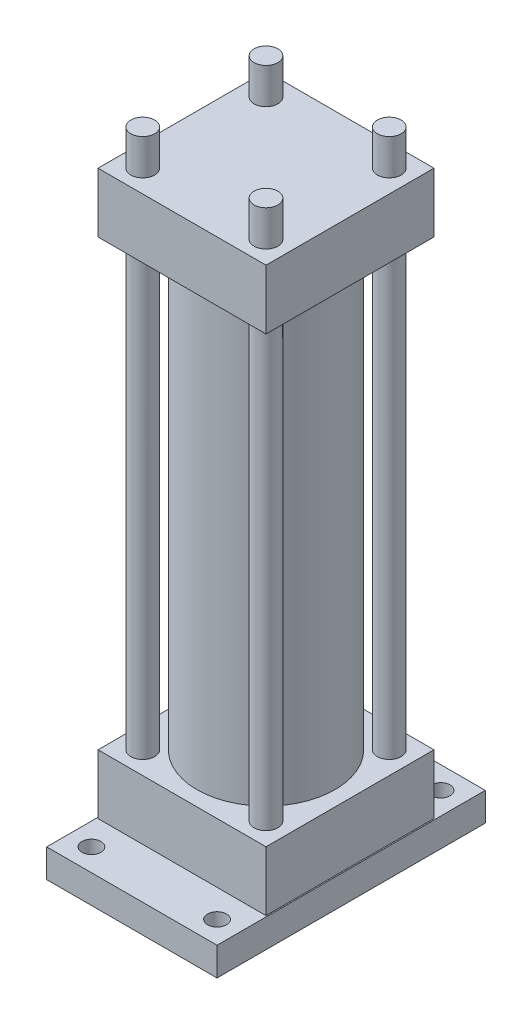
ISO-10303-21;
HEADER;
FILE_DESCRIPTION(('STEP AP214'),'2;1');
FILE_NAME('part.step','',(''),(''),'','','');
FILE_SCHEMA(('AUTOMOTIVE_DESIGN { 1 0 10303 214 1 1 1 1 }'));
ENDSEC;
DATA;
#1=APPLICATION_CONTEXT('core data for automotive mechanical design processes');
#2=APPLICATION_PROTOCOL_DEFINITION('international standard','automotive_design',2000,#1);
#3=PRODUCT_CONTEXT('',#1,'mechanical');
#4=PRODUCT('Part','Part','',(#3));
#5=PRODUCT_RELATED_PRODUCT_CATEGORY('part','',(#4));
#6=PRODUCT_DEFINITION_FORMATION('','',#4);
#7=PRODUCT_DEFINITION_CONTEXT('part definition',#1,'design');
#8=PRODUCT_DEFINITION('design','',#6,#7);
#9=PRODUCT_DEFINITION_SHAPE('','',#8);
#10=(LENGTH_UNIT() NAMED_UNIT(*) SI_UNIT(.MILLI.,.METRE.));
#11=(NAMED_UNIT(*) PLANE_ANGLE_UNIT() SI_UNIT($,.RADIAN.));
#12=(NAMED_UNIT(*) SI_UNIT($,.STERADIAN.) SOLID_ANGLE_UNIT());
#13=UNCERTAINTY_MEASURE_WITH_UNIT(LENGTH_MEASURE(1.E-05),#10,'distance_accuracy_value','');
#14=(GEOMETRIC_REPRESENTATION_CONTEXT(3) GLOBAL_UNCERTAINTY_ASSIGNED_CONTEXT((#13)) GLOBAL_UNIT_ASSIGNED_CONTEXT((#10,
#11,#12)) REPRESENTATION_CONTEXT('',''));
#15=CARTESIAN_POINT('',(0.,0.,0.));
#16=DIRECTION('',(0.,0.,1.));
#17=DIRECTION('',(1.,0.,0.));
#18=AXIS2_PLACEMENT_3D('',#15,#16,#17);
#19=CARTESIAN_POINT('',(0.,19.05,0.));
#20=DIRECTION('',(0.,-1.,0.));
#21=DIRECTION('',(0.,0.,-1.));
#22=AXIS2_PLACEMENT_3D('',#19,#20,#21);
#23=PLANE('',#22);
#24=DIRECTION('',(0.,0.,-1.));
#25=VECTOR('',#24,1.);
#26=CARTESIAN_POINT('',(57.15,19.05,90.));
#27=LINE('',#26,#25);
#28=CARTESIAN_POINT('',(57.15,19.05,90.));
#29=VERTEX_POINT('',#28);
#30=CARTESIAN_POINT('',(57.15,19.05,-90.));
#31=VERTEX_POINT('',#30);
#32=EDGE_CURVE('E245',#29,#31,#27,.T.);
#33=ORIENTED_EDGE('',*,*,#32,.T.);
#34=DIRECTION('',(-1.,0.,0.));
#35=VECTOR('',#34,1.);
#36=CARTESIAN_POINT('',(-57.15,19.05,-90.));
#37=LINE('',#36,#35);
#38=CARTESIAN_POINT('',(-57.15,19.05,-90.));
#39=VERTEX_POINT('',#38);
#40=EDGE_CURVE('E248',#31,#39,#37,.T.);
#41=ORIENTED_EDGE('',*,*,#40,.T.);
#42=DIRECTION('',(0.,0.,1.));
#43=VECTOR('',#42,1.);
#44=CARTESIAN_POINT('',(-57.15,19.05,90.));
#45=LINE('',#44,#43);
#46=CARTESIAN_POINT('',(-57.15,19.05,90.));
#47=VERTEX_POINT('',#46);
#48=EDGE_CURVE('E251',#39,#47,#45,.T.);
#49=ORIENTED_EDGE('',*,*,#48,.T.);
#50=DIRECTION('',(1.,0.,0.));
#51=VECTOR('',#50,1.);
#52=CARTESIAN_POINT('',(-57.15,19.05,90.));
#53=LINE('',#52,#51);
#54=EDGE_CURVE('E253',#47,#29,#53,.T.);
#55=ORIENTED_EDGE('',*,*,#54,.T.);
#56=EDGE_LOOP('',(#33,#41,#49,#55));
#57=FACE_BOUND('',#56,.T.);
#58=CARTESIAN_POINT('',(-42.15,19.05,-75.));
#59=DIRECTION('',(0.,1.,0.));
#60=DIRECTION('',(0.,0.,1.));
#61=AXIS2_PLACEMENT_3D('',#58,#59,#60);
#62=CIRCLE('',#61,6.35);
#63=CARTESIAN_POINT('',(-42.15,19.05,-68.65));
#64=VERTEX_POINT('',#63);
#65=EDGE_CURVE('E224',#64,#64,#62,.T.);
#66=ORIENTED_EDGE('',*,*,#65,.F.);
#67=EDGE_LOOP('',(#66));
#68=FACE_BOUND('',#67,.T.);
#69=CARTESIAN_POINT('',(-42.1500000000001,19.05,75.));
#70=DIRECTION('',(0.,1.,0.));
#71=DIRECTION('',(0.,0.,-1.));
#72=AXIS2_PLACEMENT_3D('',#69,#70,#71);
#73=CIRCLE('',#72,6.34999999999999);
#74=CARTESIAN_POINT('',(-42.1500000000001,19.05,68.65));
#75=VERTEX_POINT('',#74);
#76=EDGE_CURVE('E220',#75,#75,#73,.T.);
#77=ORIENTED_EDGE('',*,*,#76,.F.);
#78=EDGE_LOOP('',(#77));
#79=FACE_BOUND('',#78,.T.);
#80=CARTESIAN_POINT('',(42.1499999999999,19.05,75.));
#81=DIRECTION('',(0.,1.,0.));
#82=DIRECTION('',(0.,0.,1.));
#83=AXIS2_PLACEMENT_3D('',#80,#81,#82);
#84=CIRCLE('',#83,6.35);
#85=CARTESIAN_POINT('',(42.1499999999999,19.05,81.35));
#86=VERTEX_POINT('',#85);
#87=EDGE_CURVE('E231',#86,#86,#84,.T.);
#88=ORIENTED_EDGE('',*,*,#87,.F.);
#89=EDGE_LOOP('',(#88));
#90=FACE_BOUND('',#89,.T.);
#91=CARTESIAN_POINT('',(42.15,19.05,-75.));
#92=DIRECTION('',(0.,1.,0.));
#93=DIRECTION('',(0.,0.,-1.));
#94=AXIS2_PLACEMENT_3D('',#91,#92,#93);
#95=CIRCLE('',#94,6.35);
#96=CARTESIAN_POINT('',(42.15,19.05,-81.35));
#97=VERTEX_POINT('',#96);
#98=EDGE_CURVE('E225',#97,#97,#95,.T.);
#99=ORIENTED_EDGE('',*,*,#98,.F.);
#100=EDGE_LOOP('',(#99));
#101=FACE_BOUND('',#100,.T.);
#102=DIRECTION('',(0.,0.,1.));
#103=VECTOR('',#102,1.);
#104=CARTESIAN_POINT('',(-56.35625,19.05,56.35625));
#105=LINE('',#104,#103);
#106=CARTESIAN_POINT('',(-56.35625,19.05,-56.35625));
#107=VERTEX_POINT('',#106);
#108=CARTESIAN_POINT('',(-56.35625,19.05,56.35625));
#109=VERTEX_POINT('',#108);
#110=EDGE_CURVE('E192',#107,#109,#105,.T.);
#111=ORIENTED_EDGE('',*,*,#110,.F.);
#112=DIRECTION('',(-1.,0.,0.));
#113=VECTOR('',#112,1.);
#114=CARTESIAN_POINT('',(56.35625,19.05,-56.35625));
#115=LINE('',#114,#113);
#116=CARTESIAN_POINT('',(56.35625,19.05,-56.35625));
#117=VERTEX_POINT('',#116);
#118=EDGE_CURVE('E197',#117,#107,#115,.T.);
#119=ORIENTED_EDGE('',*,*,#118,.F.);
#120=DIRECTION('',(0.,0.,-1.));
#121=VECTOR('',#120,1.);
#122=CARTESIAN_POINT('',(56.35625,19.05,56.35625));
#123=LINE('',#122,#121);
#124=CARTESIAN_POINT('',(56.35625,19.05,56.35625));
#125=VERTEX_POINT('',#124);
#126=EDGE_CURVE('E59',#125,#117,#123,.T.);
#127=ORIENTED_EDGE('',*,*,#126,.F.);
#128=DIRECTION('',(1.,0.,0.));
#129=VECTOR('',#128,1.);
#130=CARTESIAN_POINT('',(56.35625,19.05,56.35625));
#131=LINE('',#130,#129);
#132=EDGE_CURVE('E54',#109,#125,#131,.T.);
#133=ORIENTED_EDGE('',*,*,#132,.F.);
#134=EDGE_LOOP('',(#111,#119,#127,#133));
#135=FACE_BOUND('',#134,.T.);
#136=ADVANCED_FACE('F38',(#57,#68,#79,#90,#101,#135),#23,.F.);
#137=CARTESIAN_POINT('',(57.15,19.05,90.));
#138=DIRECTION('',(-1.,0.,0.));
#139=DIRECTION('',(0.,0.,1.));
#140=AXIS2_PLACEMENT_3D('',#137,#138,#139);
#141=PLANE('',#140);
#142=DIRECTION('',(0.,0.,-1.));
#143=VECTOR('',#142,1.);
#144=CARTESIAN_POINT('',(57.15,0.,90.));
#145=LINE('',#144,#143);
#146=CARTESIAN_POINT('',(57.15,0.,90.));
#147=VERTEX_POINT('',#146);
#148=CARTESIAN_POINT('',(57.15,0.,-90.));
#149=VERTEX_POINT('',#148);
#150=EDGE_CURVE('E242',#147,#149,#145,.T.);
#151=ORIENTED_EDGE('',*,*,#150,.T.);
#152=DIRECTION('',(0.,-1.,0.));
#153=VECTOR('',#152,1.);
#154=CARTESIAN_POINT('',(57.15,19.05,-90.));
#155=LINE('',#154,#153);
#156=EDGE_CURVE('E271',#31,#149,#155,.T.);
#157=ORIENTED_EDGE('',*,*,#156,.F.);
#158=ORIENTED_EDGE('',*,*,#32,.F.);
#159=DIRECTION('',(0.,-1.,0.));
#160=VECTOR('',#159,1.);
#161=CARTESIAN_POINT('',(57.15,19.05,90.));
#162=LINE('',#161,#160);
#163=EDGE_CURVE('E255',#29,#147,#162,.T.);
#164=ORIENTED_EDGE('',*,*,#163,.T.);
#165=EDGE_LOOP('',(#151,#157,#158,#164));
#166=FACE_BOUND('',#165,.T.);
#167=ADVANCED_FACE('F40',(#166),#141,.F.);
#168=CARTESIAN_POINT('',(-57.15,19.05,-90.));
#169=DIRECTION('',(0.,0.,1.));
#170=DIRECTION('',(1.,0.,0.));
#171=AXIS2_PLACEMENT_3D('',#168,#169,#170);
#172=PLANE('',#171);
#173=DIRECTION('',(-1.,0.,0.));
#174=VECTOR('',#173,1.);
#175=CARTESIAN_POINT('',(-57.15,0.,-90.));
#176=LINE('',#175,#174);
#177=CARTESIAN_POINT('',(-57.15,0.,-90.));
#178=VERTEX_POINT('',#177);
#179=EDGE_CURVE('E258',#149,#178,#176,.T.);
#180=ORIENTED_EDGE('',*,*,#179,.T.);
#181=DIRECTION('',(0.,-1.,0.));
#182=VECTOR('',#181,1.);
#183=CARTESIAN_POINT('',(-57.15,19.05,-90.));
#184=LINE('',#183,#182);
#185=EDGE_CURVE('E268',#39,#178,#184,.T.);
#186=ORIENTED_EDGE('',*,*,#185,.F.);
#187=ORIENTED_EDGE('',*,*,#40,.F.);
#188=ORIENTED_EDGE('',*,*,#156,.T.);
#189=EDGE_LOOP('',(#180,#186,#187,#188));
#190=FACE_BOUND('',#189,.T.);
#191=ADVANCED_FACE('F315',(#190),#172,.F.);
#192=CARTESIAN_POINT('',(-57.15,19.05,90.));
#193=DIRECTION('',(1.,0.,0.));
#194=DIRECTION('',(0.,0.,-1.));
#195=AXIS2_PLACEMENT_3D('',#192,#193,#194);
#196=PLANE('',#195);
#197=DIRECTION('',(0.,0.,1.));
#198=VECTOR('',#197,1.);
#199=CARTESIAN_POINT('',(-57.15,0.,90.));
#200=LINE('',#199,#198);
#201=CARTESIAN_POINT('',(-57.15,0.,90.));
#202=VERTEX_POINT('',#201);
#203=EDGE_CURVE('E260',#178,#202,#200,.T.);
#204=ORIENTED_EDGE('',*,*,#203,.T.);
#205=DIRECTION('',(0.,-1.,0.));
#206=VECTOR('',#205,1.);
#207=CARTESIAN_POINT('',(-57.15,19.05,90.));
#208=LINE('',#207,#206);
#209=EDGE_CURVE('E265',#47,#202,#208,.T.);
#210=ORIENTED_EDGE('',*,*,#209,.F.);
#211=ORIENTED_EDGE('',*,*,#48,.F.);
#212=ORIENTED_EDGE('',*,*,#185,.T.);
#213=EDGE_LOOP('',(#204,#210,#211,#212));
#214=FACE_BOUND('',#213,.T.);
#215=ADVANCED_FACE('F329',(#214),#196,.F.);
#216=CARTESIAN_POINT('',(-57.15,19.05,90.));
#217=DIRECTION('',(0.,0.,-1.));
#218=DIRECTION('',(-1.,0.,0.));
#219=AXIS2_PLACEMENT_3D('',#216,#217,#218);
#220=PLANE('',#219);
#221=DIRECTION('',(1.,0.,0.));
#222=VECTOR('',#221,1.);
#223=CARTESIAN_POINT('',(-57.15,0.,90.));
#224=LINE('',#223,#222);
#225=EDGE_CURVE('E249',#202,#147,#224,.T.);
#226=ORIENTED_EDGE('',*,*,#225,.T.);
#227=ORIENTED_EDGE('',*,*,#163,.F.);
#228=ORIENTED_EDGE('',*,*,#54,.F.);
#229=ORIENTED_EDGE('',*,*,#209,.T.);
#230=EDGE_LOOP('',(#226,#227,#228,#229));
#231=FACE_BOUND('',#230,.T.);
#232=ADVANCED_FACE('F325',(#231),#220,.F.);
#233=CARTESIAN_POINT('',(0.,0.,0.));
#234=DIRECTION('',(0.,-1.,0.));
#235=DIRECTION('',(0.,0.,-1.));
#236=AXIS2_PLACEMENT_3D('',#233,#234,#235);
#237=PLANE('',#236);
#238=CARTESIAN_POINT('',(42.15,0.,-75.));
#239=DIRECTION('',(0.,1.,0.));
#240=DIRECTION('',(0.,0.,-1.));
#241=AXIS2_PLACEMENT_3D('',#238,#239,#240);
#242=CIRCLE('',#241,6.35);
#243=CARTESIAN_POINT('',(42.15,0.,-81.35));
#244=VERTEX_POINT('',#243);
#245=EDGE_CURVE('E221',#244,#244,#242,.T.);
#246=ORIENTED_EDGE('',*,*,#245,.T.);
#247=EDGE_LOOP('',(#246));
#248=FACE_BOUND('',#247,.T.);
#249=CARTESIAN_POINT('',(42.1499999999999,0.,75.));
#250=DIRECTION('',(0.,1.,0.));
#251=DIRECTION('',(0.,0.,1.));
#252=AXIS2_PLACEMENT_3D('',#249,#250,#251);
#253=CIRCLE('',#252,6.35);
#254=CARTESIAN_POINT('',(42.1499999999999,0.,81.35));
#255=VERTEX_POINT('',#254);
#256=EDGE_CURVE('E228',#255,#255,#253,.T.);
#257=ORIENTED_EDGE('',*,*,#256,.T.);
#258=EDGE_LOOP('',(#257));
#259=FACE_BOUND('',#258,.T.);
#260=CARTESIAN_POINT('',(-42.1500000000001,0.,75.));
#261=DIRECTION('',(0.,1.,0.));
#262=DIRECTION('',(0.,0.,-1.));
#263=AXIS2_PLACEMENT_3D('',#260,#261,#262);
#264=CIRCLE('',#263,6.34999999999999);
#265=CARTESIAN_POINT('',(-42.1500000000001,0.,68.65));
#266=VERTEX_POINT('',#265);
#267=EDGE_CURVE('E234',#266,#266,#264,.T.);
#268=ORIENTED_EDGE('',*,*,#267,.T.);
#269=EDGE_LOOP('',(#268));
#270=FACE_BOUND('',#269,.T.);
#271=CARTESIAN_POINT('',(-42.15,0.,-75.));
#272=DIRECTION('',(0.,1.,0.));
#273=DIRECTION('',(0.,0.,1.));
#274=AXIS2_PLACEMENT_3D('',#271,#272,#273);
#275=CIRCLE('',#274,6.35);
#276=CARTESIAN_POINT('',(-42.15,0.,-68.65));
#277=VERTEX_POINT('',#276);
#278=EDGE_CURVE('E239',#277,#277,#275,.T.);
#279=ORIENTED_EDGE('',*,*,#278,.T.);
#280=EDGE_LOOP('',(#279));
#281=FACE_BOUND('',#280,.T.);
#282=ORIENTED_EDGE('',*,*,#150,.F.);
#283=ORIENTED_EDGE('',*,*,#225,.F.);
#284=ORIENTED_EDGE('',*,*,#203,.F.);
#285=ORIENTED_EDGE('',*,*,#179,.F.);
#286=EDGE_LOOP('',(#282,#283,#284,#285));
#287=FACE_BOUND('',#286,.T.);
#288=ADVANCED_FACE('F322',(#248,#259,#270,#281,#287),#237,.T.);
#289=CARTESIAN_POINT('',(-42.15,0.,-75.));
#290=DIRECTION('',(0.,1.,0.));
#291=DIRECTION('',(0.,0.,1.));
#292=AXIS2_PLACEMENT_3D('',#289,#290,#291);
#293=CYLINDRICAL_SURFACE('',#292,6.35);
#294=ORIENTED_EDGE('',*,*,#278,.F.);
#295=EDGE_LOOP('',(#294));
#296=FACE_BOUND('',#295,.T.);
#297=ORIENTED_EDGE('',*,*,#65,.T.);
#298=EDGE_LOOP('',(#297));
#299=FACE_BOUND('',#298,.T.);
#300=ADVANCED_FACE('F320',(#296,#299),#293,.F.);
#301=CARTESIAN_POINT('',(-42.1500000000001,0.,75.));
#302=DIRECTION('',(0.,1.,0.));
#303=DIRECTION('',(0.,0.,1.));
#304=AXIS2_PLACEMENT_3D('',#301,#302,#303);
#305=CYLINDRICAL_SURFACE('',#304,6.34999999999999);
#306=ORIENTED_EDGE('',*,*,#267,.F.);
#307=EDGE_LOOP('',(#306));
#308=FACE_BOUND('',#307,.T.);
#309=ORIENTED_EDGE('',*,*,#76,.T.);
#310=EDGE_LOOP('',(#309));
#311=FACE_BOUND('',#310,.T.);
#312=ADVANCED_FACE('F368',(#308,#311),#305,.F.);
#313=CARTESIAN_POINT('',(42.1499999999999,0.,75.));
#314=DIRECTION('',(0.,1.,0.));
#315=DIRECTION('',(0.,0.,1.));
#316=AXIS2_PLACEMENT_3D('',#313,#314,#315);
#317=CYLINDRICAL_SURFACE('',#316,6.35);
#318=ORIENTED_EDGE('',*,*,#256,.F.);
#319=EDGE_LOOP('',(#318));
#320=FACE_BOUND('',#319,.T.);
#321=ORIENTED_EDGE('',*,*,#87,.T.);
#322=EDGE_LOOP('',(#321));
#323=FACE_BOUND('',#322,.T.);
#324=ADVANCED_FACE('F375',(#320,#323),#317,.F.);
#325=CARTESIAN_POINT('',(42.15,0.,-75.));
#326=DIRECTION('',(0.,1.,0.));
#327=DIRECTION('',(0.,0.,1.));
#328=AXIS2_PLACEMENT_3D('',#325,#326,#327);
#329=CYLINDRICAL_SURFACE('',#328,6.35);
#330=ORIENTED_EDGE('',*,*,#245,.F.);
#331=EDGE_LOOP('',(#330));
#332=FACE_BOUND('',#331,.T.);
#333=ORIENTED_EDGE('',*,*,#98,.T.);
#334=EDGE_LOOP('',(#333));
#335=FACE_BOUND('',#334,.T.);
#336=ADVANCED_FACE('F382',(#332,#335),#329,.F.);
#337=CARTESIAN_POINT('',(-56.35625,59.05,56.35625));
#338=DIRECTION('',(1.,0.,0.));
#339=DIRECTION('',(0.,0.,-1.));
#340=AXIS2_PLACEMENT_3D('',#337,#338,#339);
#341=PLANE('',#340);
#342=ORIENTED_EDGE('',*,*,#110,.T.);
#343=DIRECTION('',(0.,-1.,0.));
#344=VECTOR('',#343,1.);
#345=CARTESIAN_POINT('',(-56.35625,59.05,56.35625));
#346=LINE('',#345,#344);
#347=CARTESIAN_POINT('',(-56.35625,59.05,56.35625));
#348=VERTEX_POINT('',#347);
#349=EDGE_CURVE('E218',#348,#109,#346,.T.);
#350=ORIENTED_EDGE('',*,*,#349,.F.);
#351=DIRECTION('',(0.,0.,1.));
#352=VECTOR('',#351,1.);
#353=CARTESIAN_POINT('',(-56.35625,59.05,56.35625));
#354=LINE('',#353,#352);
#355=CARTESIAN_POINT('',(-56.35625,59.05,-56.35625));
#356=VERTEX_POINT('',#355);
#357=EDGE_CURVE('E193',#356,#348,#354,.T.);
#358=ORIENTED_EDGE('',*,*,#357,.F.);
#359=DIRECTION('',(0.,-1.,0.));
#360=VECTOR('',#359,1.);
#361=CARTESIAN_POINT('',(-56.35625,59.05,-56.35625));
#362=LINE('',#361,#360);
#363=EDGE_CURVE('E203',#356,#107,#362,.T.);
#364=ORIENTED_EDGE('',*,*,#363,.T.);
#365=EDGE_LOOP('',(#342,#350,#358,#364));
#366=FACE_BOUND('',#365,.T.);
#367=ADVANCED_FACE('F390',(#366),#341,.F.);
#368=CARTESIAN_POINT('',(56.35625,59.05,56.35625));
#369=DIRECTION('',(0.,0.,-1.));
#370=DIRECTION('',(-1.,0.,0.));
#371=AXIS2_PLACEMENT_3D('',#368,#369,#370);
#372=PLANE('',#371);
#373=ORIENTED_EDGE('',*,*,#132,.T.);
#374=DIRECTION('',(0.,-1.,0.));
#375=VECTOR('',#374,1.);
#376=CARTESIAN_POINT('',(56.35625,59.05,56.35625));
#377=LINE('',#376,#375);
#378=CARTESIAN_POINT('',(56.35625,59.05,56.35625));
#379=VERTEX_POINT('',#378);
#380=EDGE_CURVE('E215',#379,#125,#377,.T.);
#381=ORIENTED_EDGE('',*,*,#380,.F.);
#382=DIRECTION('',(1.,0.,0.));
#383=VECTOR('',#382,1.);
#384=CARTESIAN_POINT('',(56.35625,59.05,56.35625));
#385=LINE('',#384,#383);
#386=EDGE_CURVE('E196',#348,#379,#385,.T.);
#387=ORIENTED_EDGE('',*,*,#386,.F.);
#388=ORIENTED_EDGE('',*,*,#349,.T.);
#389=EDGE_LOOP('',(#373,#381,#387,#388));
#390=FACE_BOUND('',#389,.T.);
#391=ADVANCED_FACE('F398',(#390),#372,.F.);
#392=CARTESIAN_POINT('',(56.35625,59.05,56.35625));
#393=DIRECTION('',(-1.,0.,0.));
#394=DIRECTION('',(0.,0.,1.));
#395=AXIS2_PLACEMENT_3D('',#392,#393,#394);
#396=PLANE('',#395);
#397=ORIENTED_EDGE('',*,*,#126,.T.);
#398=DIRECTION('',(0.,-1.,0.));
#399=VECTOR('',#398,1.);
#400=CARTESIAN_POINT('',(56.35625,59.05,-56.35625));
#401=LINE('',#400,#399);
#402=CARTESIAN_POINT('',(56.35625,59.05,-56.35625));
#403=VERTEX_POINT('',#402);
#404=EDGE_CURVE('E212',#403,#117,#401,.T.);
#405=ORIENTED_EDGE('',*,*,#404,.F.);
#406=DIRECTION('',(0.,0.,-1.));
#407=VECTOR('',#406,1.);
#408=CARTESIAN_POINT('',(56.35625,59.05,56.35625));
#409=LINE('',#408,#407);
#410=EDGE_CURVE('E199',#379,#403,#409,.T.);
#411=ORIENTED_EDGE('',*,*,#410,.F.);
#412=ORIENTED_EDGE('',*,*,#380,.T.);
#413=EDGE_LOOP('',(#397,#405,#411,#412));
#414=FACE_BOUND('',#413,.T.);
#415=ADVANCED_FACE('F406',(#414),#396,.F.);
#416=CARTESIAN_POINT('',(56.35625,59.05,-56.35625));
#417=DIRECTION('',(0.,0.,1.));
#418=DIRECTION('',(1.,0.,0.));
#419=AXIS2_PLACEMENT_3D('',#416,#417,#418);
#420=PLANE('',#419);
#421=ORIENTED_EDGE('',*,*,#118,.T.);
#422=ORIENTED_EDGE('',*,*,#363,.F.);
#423=DIRECTION('',(-1.,0.,0.));
#424=VECTOR('',#423,1.);
#425=CARTESIAN_POINT('',(56.35625,59.05,-56.35625));
#426=LINE('',#425,#424);
#427=EDGE_CURVE('E201',#403,#356,#426,.T.);
#428=ORIENTED_EDGE('',*,*,#427,.F.);
#429=ORIENTED_EDGE('',*,*,#404,.T.);
#430=EDGE_LOOP('',(#421,#422,#428,#429));
#431=FACE_BOUND('',#430,.T.);
#432=ADVANCED_FACE('F414',(#431),#420,.F.);
#433=CARTESIAN_POINT('',(0.,59.05,0.));
#434=DIRECTION('',(0.,1.,0.));
#435=DIRECTION('',(0.,0.,1.));
#436=AXIS2_PLACEMENT_3D('',#433,#434,#435);
#437=PLANE('',#436);
#438=CARTESIAN_POINT('',(0.,59.05,0.));
#439=DIRECTION('',(0.,1.,0.));
#440=DIRECTION('',(0.,0.,1.));
#441=AXIS2_PLACEMENT_3D('',#438,#439,#440);
#442=CIRCLE('',#441,46.355);
#443=CARTESIAN_POINT('',(0.,59.05,46.355));
#444=VERTEX_POINT('',#443);
#445=EDGE_CURVE('E151',#444,#444,#442,.T.);
#446=ORIENTED_EDGE('',*,*,#445,.F.);
#447=EDGE_LOOP('',(#446));
#448=FACE_BOUND('',#447,.T.);
#449=CARTESIAN_POINT('',(41.35625,59.05,-41.35625));
#450=DIRECTION('',(0.,1.,0.));
#451=DIRECTION('',(0.,0.,-1.));
#452=AXIS2_PLACEMENT_3D('',#449,#450,#451);
#453=CIRCLE('',#452,8.);
#454=CARTESIAN_POINT('',(41.35625,59.05,-49.35625));
#455=VERTEX_POINT('',#454);
#456=EDGE_CURVE('E181',#455,#455,#453,.T.);
#457=ORIENTED_EDGE('',*,*,#456,.F.);
#458=EDGE_LOOP('',(#457));
#459=FACE_BOUND('',#458,.T.);
#460=CARTESIAN_POINT('',(41.35625,59.05,41.35625));
#461=DIRECTION('',(0.,1.,0.));
#462=DIRECTION('',(0.,0.,1.));
#463=AXIS2_PLACEMENT_3D('',#460,#461,#462);
#464=CIRCLE('',#463,8.);
#465=CARTESIAN_POINT('',(41.35625,59.05,49.35625));
#466=VERTEX_POINT('',#465);
#467=EDGE_CURVE('E185',#466,#466,#464,.T.);
#468=ORIENTED_EDGE('',*,*,#467,.F.);
#469=EDGE_LOOP('',(#468));
#470=FACE_BOUND('',#469,.T.);
#471=CARTESIAN_POINT('',(-41.35625,59.05,41.35625));
#472=DIRECTION('',(0.,1.,0.));
#473=DIRECTION('',(0.,0.,-1.));
#474=AXIS2_PLACEMENT_3D('',#471,#472,#473);
#475=CIRCLE('',#474,8.);
#476=CARTESIAN_POINT('',(-41.35625,59.05,33.35625));
#477=VERTEX_POINT('',#476);
#478=EDGE_CURVE('E180',#477,#477,#475,.T.);
#479=ORIENTED_EDGE('',*,*,#478,.F.);
#480=EDGE_LOOP('',(#479));
#481=FACE_BOUND('',#480,.T.);
#482=CARTESIAN_POINT('',(-41.35625,59.05,-41.35625));
#483=DIRECTION('',(0.,1.,0.));
#484=DIRECTION('',(0.,0.,1.));
#485=AXIS2_PLACEMENT_3D('',#482,#483,#484);
#486=CIRCLE('',#485,8.);
#487=CARTESIAN_POINT('',(-41.35625,59.05,-33.35625));
#488=VERTEX_POINT('',#487);
#489=EDGE_CURVE('E184',#488,#488,#486,.T.);
#490=ORIENTED_EDGE('',*,*,#489,.F.);
#491=EDGE_LOOP('',(#490));
#492=FACE_BOUND('',#491,.T.);
#493=ORIENTED_EDGE('',*,*,#357,.T.);
#494=ORIENTED_EDGE('',*,*,#386,.T.);
#495=ORIENTED_EDGE('',*,*,#410,.T.);
#496=ORIENTED_EDGE('',*,*,#427,.T.);
#497=EDGE_LOOP('',(#493,#494,#495,#496));
#498=FACE_BOUND('',#497,.T.);
#499=ADVANCED_FACE('F422',(#448,#459,#470,#481,#492,#498),#437,.T.);
#500=CARTESIAN_POINT('',(-41.35625,357.05,-41.35625));
#501=DIRECTION('',(0.,-1.,0.));
#502=DIRECTION('',(0.,0.,-1.));
#503=AXIS2_PLACEMENT_3D('',#500,#501,#502);
#504=CYLINDRICAL_SURFACE('',#503,8.);
#505=ORIENTED_EDGE('',*,*,#489,.T.);
#506=EDGE_LOOP('',(#505));
#507=FACE_BOUND('',#506,.T.);
#508=CARTESIAN_POINT('',(-41.35625,357.05,-41.35625));
#509=DIRECTION('',(0.,1.,0.));
#510=DIRECTION('',(0.,0.,1.));
#511=AXIS2_PLACEMENT_3D('',#508,#509,#510);
#512=CIRCLE('',#511,8.);
#513=CARTESIAN_POINT('',(-41.35625,357.05,-33.35625));
#514=VERTEX_POINT('',#513);
#515=EDGE_CURVE('E177',#514,#514,#512,.T.);
#516=ORIENTED_EDGE('',*,*,#515,.F.);
#517=EDGE_LOOP('',(#516));
#518=FACE_BOUND('',#517,.T.);
#519=ADVANCED_FACE('F431',(#507,#518),#504,.T.);
#520=CARTESIAN_POINT('',(41.35625,357.05,-41.35625));
#521=DIRECTION('',(0.,-1.,0.));
#522=DIRECTION('',(0.,0.,-1.));
#523=AXIS2_PLACEMENT_3D('',#520,#521,#522);
#524=CYLINDRICAL_SURFACE('',#523,8.00000000000001);
#525=ORIENTED_EDGE('',*,*,#456,.T.);
#526=EDGE_LOOP('',(#525));
#527=FACE_BOUND('',#526,.T.);
#528=CARTESIAN_POINT('',(41.35625,357.05,-41.35625));
#529=DIRECTION('',(0.,1.,0.));
#530=DIRECTION('',(0.,0.,1.));
#531=AXIS2_PLACEMENT_3D('',#528,#529,#530);
#532=CIRCLE('',#531,8.00000000000001);
#533=CARTESIAN_POINT('',(41.35625,357.05,-33.35625));
#534=VERTEX_POINT('',#533);
#535=EDGE_CURVE('E174',#534,#534,#532,.T.);
#536=ORIENTED_EDGE('',*,*,#535,.F.);
#537=EDGE_LOOP('',(#536));
#538=FACE_BOUND('',#537,.T.);
#539=ADVANCED_FACE('F440',(#527,#538),#524,.T.);
#540=CARTESIAN_POINT('',(41.35625,357.05,41.35625));
#541=DIRECTION('',(0.,-1.,0.));
#542=DIRECTION('',(0.,0.,-1.));
#543=AXIS2_PLACEMENT_3D('',#540,#541,#542);
#544=CYLINDRICAL_SURFACE('',#543,8.);
#545=ORIENTED_EDGE('',*,*,#467,.T.);
#546=EDGE_LOOP('',(#545));
#547=FACE_BOUND('',#546,.T.);
#548=CARTESIAN_POINT('',(41.35625,357.05,41.35625));
#549=DIRECTION('',(0.,1.,0.));
#550=DIRECTION('',(0.,0.,1.));
#551=AXIS2_PLACEMENT_3D('',#548,#549,#550);
#552=CIRCLE('',#551,8.);
#553=CARTESIAN_POINT('',(41.35625,357.05,49.35625));
#554=VERTEX_POINT('',#553);
#555=EDGE_CURVE('E171',#554,#554,#552,.T.);
#556=ORIENTED_EDGE('',*,*,#555,.F.);
#557=EDGE_LOOP('',(#556));
#558=FACE_BOUND('',#557,.T.);
#559=ADVANCED_FACE('F448',(#547,#558),#544,.T.);
#560=CARTESIAN_POINT('',(-41.35625,357.05,41.35625));
#561=DIRECTION('',(0.,-1.,0.));
#562=DIRECTION('',(0.,0.,-1.));
#563=AXIS2_PLACEMENT_3D('',#560,#561,#562);
#564=CYLINDRICAL_SURFACE('',#563,8.00000000000001);
#565=ORIENTED_EDGE('',*,*,#478,.T.);
#566=EDGE_LOOP('',(#565));
#567=FACE_BOUND('',#566,.T.);
#568=CARTESIAN_POINT('',(-41.35625,357.05,41.35625));
#569=DIRECTION('',(0.,1.,0.));
#570=DIRECTION('',(0.,0.,1.));
#571=AXIS2_PLACEMENT_3D('',#568,#569,#570);
#572=CIRCLE('',#571,8.00000000000001);
#573=CARTESIAN_POINT('',(-41.35625,357.05,49.35625));
#574=VERTEX_POINT('',#573);
#575=EDGE_CURVE('E168',#574,#574,#572,.T.);
#576=ORIENTED_EDGE('',*,*,#575,.F.);
#577=EDGE_LOOP('',(#576));
#578=FACE_BOUND('',#577,.T.);
#579=ADVANCED_FACE('F456',(#567,#578),#564,.T.);
#580=CARTESIAN_POINT('',(0.,357.05,0.));
#581=DIRECTION('',(0.,-1.,0.));
#582=DIRECTION('',(0.,0.,-1.));
#583=AXIS2_PLACEMENT_3D('',#580,#581,#582);
#584=CYLINDRICAL_SURFACE('',#583,46.355);
#585=CARTESIAN_POINT('',(0.,357.05,0.));
#586=DIRECTION('',(0.,1.,0.));
#587=DIRECTION('',(0.,0.,1.));
#588=AXIS2_PLACEMENT_3D('',#585,#586,#587);
#589=CIRCLE('',#588,46.355);
#590=CARTESIAN_POINT('',(0.,357.05,46.355));
#591=VERTEX_POINT('',#590);
#592=EDGE_CURVE('E154',#591,#591,#589,.T.);
#593=ORIENTED_EDGE('',*,*,#592,.F.);
#594=EDGE_LOOP('',(#593));
#595=FACE_BOUND('',#594,.T.);
#596=ORIENTED_EDGE('',*,*,#445,.T.);
#597=EDGE_LOOP('',(#596));
#598=FACE_BOUND('',#597,.T.);
#599=ADVANCED_FACE('F464',(#595,#598),#584,.T.);
#600=CARTESIAN_POINT('',(56.35625,397.05,56.35625));
#601=DIRECTION('',(-1.,0.,0.));
#602=DIRECTION('',(0.,0.,1.));
#603=AXIS2_PLACEMENT_3D('',#600,#601,#602);
#604=PLANE('',#603);
#605=DIRECTION('',(0.,0.,-1.));
#606=VECTOR('',#605,1.);
#607=CARTESIAN_POINT('',(56.35625,357.05,56.35625));
#608=LINE('',#607,#606);
#609=CARTESIAN_POINT('',(56.35625,357.05,56.35625));
#610=VERTEX_POINT('',#609);
#611=CARTESIAN_POINT('',(56.35625,357.05,-56.35625));
#612=VERTEX_POINT('',#611);
#613=EDGE_CURVE('E150',#610,#612,#608,.T.);
#614=ORIENTED_EDGE('',*,*,#613,.T.);
#615=DIRECTION('',(0.,-1.,0.));
#616=VECTOR('',#615,1.);
#617=CARTESIAN_POINT('',(56.35625,397.05,-56.35625));
#618=LINE('',#617,#616);
#619=CARTESIAN_POINT('',(56.35625,397.05,-56.35625));
#620=VERTEX_POINT('',#619);
#621=EDGE_CURVE('E130',#620,#612,#618,.T.);
#622=ORIENTED_EDGE('',*,*,#621,.F.);
#623=DIRECTION('',(0.,0.,-1.));
#624=VECTOR('',#623,1.);
#625=CARTESIAN_POINT('',(56.35625,397.05,56.35625));
#626=LINE('',#625,#624);
#627=CARTESIAN_POINT('',(56.35625,397.05,56.35625));
#628=VERTEX_POINT('',#627);
#629=EDGE_CURVE('E137',#628,#620,#626,.T.);
#630=ORIENTED_EDGE('',*,*,#629,.F.);
#631=DIRECTION('',(0.,-1.,0.));
#632=VECTOR('',#631,1.);
#633=CARTESIAN_POINT('',(56.35625,397.05,56.35625));
#634=LINE('',#633,#632);
#635=EDGE_CURVE('E682',#628,#610,#634,.T.);
#636=ORIENTED_EDGE('',*,*,#635,.T.);
#637=EDGE_LOOP('',(#614,#622,#630,#636));
#638=FACE_BOUND('',#637,.T.);
#639=ADVANCED_FACE('F148',(#638),#604,.F.);
#640=CARTESIAN_POINT('',(-56.35625,397.05,-56.35625));
#641=DIRECTION('',(0.,0.,1.));
#642=DIRECTION('',(1.,0.,0.));
#643=AXIS2_PLACEMENT_3D('',#640,#641,#642);
#644=PLANE('',#643);
#645=DIRECTION('',(-1.,0.,0.));
#646=VECTOR('',#645,1.);
#647=CARTESIAN_POINT('',(-56.35625,357.05,-56.35625));
#648=LINE('',#647,#646);
#649=CARTESIAN_POINT('',(-56.35625,357.05,-56.35625));
#650=VERTEX_POINT('',#649);
#651=EDGE_CURVE('E684',#612,#650,#648,.T.);
#652=ORIENTED_EDGE('',*,*,#651,.T.);
#653=DIRECTION('',(0.,-1.,0.));
#654=VECTOR('',#653,1.);
#655=CARTESIAN_POINT('',(-56.35625,397.05,-56.35625));
#656=LINE('',#655,#654);
#657=CARTESIAN_POINT('',(-56.35625,397.05,-56.35625));
#658=VERTEX_POINT('',#657);
#659=EDGE_CURVE('E133',#658,#650,#656,.T.);
#660=ORIENTED_EDGE('',*,*,#659,.F.);
#661=DIRECTION('',(-1.,0.,0.));
#662=VECTOR('',#661,1.);
#663=CARTESIAN_POINT('',(-56.35625,397.05,-56.35625));
#664=LINE('',#663,#662);
#665=EDGE_CURVE('E126',#620,#658,#664,.T.);
#666=ORIENTED_EDGE('',*,*,#665,.F.);
#667=ORIENTED_EDGE('',*,*,#621,.T.);
#668=EDGE_LOOP('',(#652,#660,#666,#667));
#669=FACE_BOUND('',#668,.T.);
#670=ADVANCED_FACE('F128',(#669),#644,.F.);
#671=CARTESIAN_POINT('',(-56.35625,397.05,56.35625));
#672=DIRECTION('',(1.,0.,0.));
#673=DIRECTION('',(0.,0.,-1.));
#674=AXIS2_PLACEMENT_3D('',#671,#672,#673);
#675=PLANE('',#674);
#676=DIRECTION('',(0.,0.,1.));
#677=VECTOR('',#676,1.);
#678=CARTESIAN_POINT('',(-56.35625,357.05,56.35625));
#679=LINE('',#678,#677);
#680=CARTESIAN_POINT('',(-56.35625,357.05,56.35625));
#681=VERTEX_POINT('',#680);
#682=EDGE_CURVE('E686',#650,#681,#679,.T.);
#683=ORIENTED_EDGE('',*,*,#682,.T.);
#684=DIRECTION('',(0.,-1.,0.));
#685=VECTOR('',#684,1.);
#686=CARTESIAN_POINT('',(-56.35625,397.05,56.35625));
#687=LINE('',#686,#685);
#688=CARTESIAN_POINT('',(-56.35625,397.05,56.35625));
#689=VERTEX_POINT('',#688);
#690=EDGE_CURVE('E156',#689,#681,#687,.T.);
#691=ORIENTED_EDGE('',*,*,#690,.F.);
#692=DIRECTION('',(0.,0.,1.));
#693=VECTOR('',#692,1.);
#694=CARTESIAN_POINT('',(-56.35625,397.05,56.35625));
#695=LINE('',#694,#693);
#696=EDGE_CURVE('E136',#658,#689,#695,.T.);
#697=ORIENTED_EDGE('',*,*,#696,.F.);
#698=ORIENTED_EDGE('',*,*,#659,.T.);
#699=EDGE_LOOP('',(#683,#691,#697,#698));
#700=FACE_BOUND('',#699,.T.);
#701=ADVANCED_FACE('F486',(#700),#675,.F.);
#702=CARTESIAN_POINT('',(-56.35625,397.05,56.35625));
#703=DIRECTION('',(0.,0.,-1.));
#704=DIRECTION('',(-1.,0.,0.));
#705=AXIS2_PLACEMENT_3D('',#702,#703,#704);
#706=PLANE('',#705);
#707=DIRECTION('',(1.,0.,0.));
#708=VECTOR('',#707,1.);
#709=CARTESIAN_POINT('',(-56.35625,357.05,56.35625));
#710=LINE('',#709,#708);
#711=EDGE_CURVE('E146',#681,#610,#710,.T.);
#712=ORIENTED_EDGE('',*,*,#711,.T.);
#713=ORIENTED_EDGE('',*,*,#635,.F.);
#714=DIRECTION('',(1.,0.,0.));
#715=VECTOR('',#714,1.);
#716=CARTESIAN_POINT('',(-56.35625,397.05,56.35625));
#717=LINE('',#716,#715);
#718=EDGE_CURVE('E142',#689,#628,#717,.T.);
#719=ORIENTED_EDGE('',*,*,#718,.F.);
#720=ORIENTED_EDGE('',*,*,#690,.T.);
#721=EDGE_LOOP('',(#712,#713,#719,#720));
#722=FACE_BOUND('',#721,.T.);
#723=ADVANCED_FACE('F287',(#722),#706,.F.);
#724=CARTESIAN_POINT('',(0.,397.05,0.));
#725=DIRECTION('',(0.,-1.,0.));
#726=DIRECTION('',(0.,0.,-1.));
#727=AXIS2_PLACEMENT_3D('',#724,#725,#726);
#728=PLANE('',#727);
#729=CARTESIAN_POINT('',(41.35625,397.05,41.35625));
#730=DIRECTION('',(0.,-1.,0.));
#731=DIRECTION('',(0.,0.,-1.));
#732=AXIS2_PLACEMENT_3D('',#729,#730,#731);
#733=CIRCLE('',#732,8.);
#734=CARTESIAN_POINT('',(41.35625,397.05,33.35625));
#735=VERTEX_POINT('',#734);
#736=EDGE_CURVE('E11',#735,#735,#733,.F.);
#737=ORIENTED_EDGE('',*,*,#736,.F.);
#738=EDGE_LOOP('',(#737));
#739=FACE_BOUND('',#738,.T.);
#740=CARTESIAN_POINT('',(-41.35625,397.05,41.35625));
#741=DIRECTION('',(0.,-1.,0.));
#742=DIRECTION('',(0.,0.,-1.));
#743=AXIS2_PLACEMENT_3D('',#740,#741,#742);
#744=CIRCLE('',#743,8.00000000000001);
#745=CARTESIAN_POINT('',(-41.35625,397.05,33.35625));
#746=VERTEX_POINT('',#745);
#747=EDGE_CURVE('E47',#746,#746,#744,.F.);
#748=ORIENTED_EDGE('',*,*,#747,.F.);
#749=EDGE_LOOP('',(#748));
#750=FACE_BOUND('',#749,.T.);
#751=CARTESIAN_POINT('',(41.35625,397.05,-41.35625));
#752=DIRECTION('',(0.,-1.,0.));
#753=DIRECTION('',(0.,0.,-1.));
#754=AXIS2_PLACEMENT_3D('',#751,#752,#753);
#755=CIRCLE('',#754,8.00000000000001);
#756=CARTESIAN_POINT('',(41.35625,397.05,-49.35625));
#757=VERTEX_POINT('',#756);
#758=EDGE_CURVE('E277',#757,#757,#755,.F.);
#759=ORIENTED_EDGE('',*,*,#758,.F.);
#760=EDGE_LOOP('',(#759));
#761=FACE_BOUND('',#760,.T.);
#762=CARTESIAN_POINT('',(-41.35625,397.05,-41.35625));
#763=DIRECTION('',(0.,-1.,0.));
#764=DIRECTION('',(0.,0.,-1.));
#765=AXIS2_PLACEMENT_3D('',#762,#763,#764);
#766=CIRCLE('',#765,8.);
#767=CARTESIAN_POINT('',(-41.35625,397.05,-49.35625));
#768=VERTEX_POINT('',#767);
#769=EDGE_CURVE('E274',#768,#768,#766,.F.);
#770=ORIENTED_EDGE('',*,*,#769,.F.);
#771=EDGE_LOOP('',(#770));
#772=FACE_BOUND('',#771,.T.);
#773=ORIENTED_EDGE('',*,*,#629,.T.);
#774=ORIENTED_EDGE('',*,*,#665,.T.);
#775=ORIENTED_EDGE('',*,*,#696,.T.);
#776=ORIENTED_EDGE('',*,*,#718,.T.);
#777=EDGE_LOOP('',(#773,#774,#775,#776));
#778=FACE_BOUND('',#777,.T.);
#779=ADVANCED_FACE('F140',(#739,#750,#761,#772,#778),#728,.F.);
#780=CARTESIAN_POINT('',(0.,357.05,0.));
#781=DIRECTION('',(0.,-1.,0.));
#782=DIRECTION('',(0.,0.,-1.));
#783=AXIS2_PLACEMENT_3D('',#780,#781,#782);
#784=PLANE('',#783);
#785=ORIENTED_EDGE('',*,*,#515,.T.);
#786=EDGE_LOOP('',(#785));
#787=FACE_BOUND('',#786,.T.);
#788=ORIENTED_EDGE('',*,*,#535,.T.);
#789=EDGE_LOOP('',(#788));
#790=FACE_BOUND('',#789,.T.);
#791=ORIENTED_EDGE('',*,*,#555,.T.);
#792=EDGE_LOOP('',(#791));
#793=FACE_BOUND('',#792,.T.);
#794=ORIENTED_EDGE('',*,*,#575,.T.);
#795=EDGE_LOOP('',(#794));
#796=FACE_BOUND('',#795,.T.);
#797=ORIENTED_EDGE('',*,*,#592,.T.);
#798=EDGE_LOOP('',(#797));
#799=FACE_BOUND('',#798,.T.);
#800=ORIENTED_EDGE('',*,*,#613,.F.);
#801=ORIENTED_EDGE('',*,*,#711,.F.);
#802=ORIENTED_EDGE('',*,*,#682,.F.);
#803=ORIENTED_EDGE('',*,*,#651,.F.);
#804=EDGE_LOOP('',(#800,#801,#802,#803));
#805=FACE_BOUND('',#804,.T.);
#806=ADVANCED_FACE('F286',(#787,#790,#793,#796,#799,#805),#784,.T.);
#807=CARTESIAN_POINT('',(-41.35625,421.05,-41.35625));
#808=DIRECTION('',(0.,-1.,0.));
#809=DIRECTION('',(0.,0.,-1.));
#810=AXIS2_PLACEMENT_3D('',#807,#808,#809);
#811=CYLINDRICAL_SURFACE('',#810,8.);
#812=CARTESIAN_POINT('',(-41.35625,421.05,-41.35625));
#813=DIRECTION('',(0.,1.,0.));
#814=DIRECTION('',(0.,0.,1.));
#815=AXIS2_PLACEMENT_3D('',#812,#813,#814);
#816=CIRCLE('',#815,8.);
#817=CARTESIAN_POINT('',(-41.35625,421.05,-33.35625));
#818=VERTEX_POINT('',#817);
#819=EDGE_CURVE('E677',#818,#818,#816,.T.);
#820=ORIENTED_EDGE('',*,*,#819,.F.);
#821=EDGE_LOOP('',(#820));
#822=FACE_BOUND('',#821,.T.);
#823=ORIENTED_EDGE('',*,*,#769,.T.);
#824=EDGE_LOOP('',(#823));
#825=FACE_BOUND('',#824,.T.);
#826=ADVANCED_FACE('F294',(#822,#825),#811,.T.);
#827=CARTESIAN_POINT('',(-41.35625,421.05,-41.35625));
#828=DIRECTION('',(0.,1.,0.));
#829=DIRECTION('',(0.,0.,1.));
#830=AXIS2_PLACEMENT_3D('',#827,#828,#829);
#831=PLANE('',#830);
#832=ORIENTED_EDGE('',*,*,#819,.T.);
#833=EDGE_LOOP('',(#832));
#834=FACE_BOUND('',#833,.T.);
#835=ADVANCED_FACE('F296',(#834),#831,.T.);
#836=CARTESIAN_POINT('',(41.35625,421.05,-41.35625));
#837=DIRECTION('',(0.,-1.,0.));
#838=DIRECTION('',(0.,0.,-1.));
#839=AXIS2_PLACEMENT_3D('',#836,#837,#838);
#840=CYLINDRICAL_SURFACE('',#839,8.00000000000001);
#841=CARTESIAN_POINT('',(41.35625,421.05,-41.35625));
#842=DIRECTION('',(0.,1.,0.));
#843=DIRECTION('',(0.,0.,1.));
#844=AXIS2_PLACEMENT_3D('',#841,#842,#843);
#845=CIRCLE('',#844,8.00000000000001);
#846=CARTESIAN_POINT('',(41.35625,421.05,-33.35625));
#847=VERTEX_POINT('',#846);
#848=EDGE_CURVE('E672',#847,#847,#845,.T.);
#849=ORIENTED_EDGE('',*,*,#848,.F.);
#850=EDGE_LOOP('',(#849));
#851=FACE_BOUND('',#850,.T.);
#852=ORIENTED_EDGE('',*,*,#758,.T.);
#853=EDGE_LOOP('',(#852));
#854=FACE_BOUND('',#853,.T.);
#855=ADVANCED_FACE('F303',(#851,#854),#840,.T.);
#856=CARTESIAN_POINT('',(41.35625,421.05,-41.35625));
#857=DIRECTION('',(0.,1.,0.));
#858=DIRECTION('',(0.,0.,1.));
#859=AXIS2_PLACEMENT_3D('',#856,#857,#858);
#860=PLANE('',#859);
#861=ORIENTED_EDGE('',*,*,#848,.T.);
#862=EDGE_LOOP('',(#861));
#863=FACE_BOUND('',#862,.T.);
#864=ADVANCED_FACE('F530',(#863),#860,.T.);
#865=CARTESIAN_POINT('',(-41.35625,421.05,41.35625));
#866=DIRECTION('',(0.,-1.,0.));
#867=DIRECTION('',(0.,0.,-1.));
#868=AXIS2_PLACEMENT_3D('',#865,#866,#867);
#869=CYLINDRICAL_SURFACE('',#868,8.00000000000001);
#870=CARTESIAN_POINT('',(-41.35625,421.05,41.35625));
#871=DIRECTION('',(0.,1.,0.));
#872=DIRECTION('',(0.,0.,1.));
#873=AXIS2_PLACEMENT_3D('',#870,#871,#872);
#874=CIRCLE('',#873,8.00000000000001);
#875=CARTESIAN_POINT('',(-41.35625,421.05,49.35625));
#876=VERTEX_POINT('',#875);
#877=EDGE_CURVE('E669',#876,#876,#874,.T.);
#878=ORIENTED_EDGE('',*,*,#877,.F.);
#879=EDGE_LOOP('',(#878));
#880=FACE_BOUND('',#879,.T.);
#881=ORIENTED_EDGE('',*,*,#747,.T.);
#882=EDGE_LOOP('',(#881));
#883=FACE_BOUND('',#882,.T.);
#884=ADVANCED_FACE('F282',(#880,#883),#869,.T.);
#885=CARTESIAN_POINT('',(-41.35625,421.05,41.35625));
#886=DIRECTION('',(0.,1.,0.));
#887=DIRECTION('',(0.,0.,1.));
#888=AXIS2_PLACEMENT_3D('',#885,#886,#887);
#889=PLANE('',#888);
#890=ORIENTED_EDGE('',*,*,#877,.T.);
#891=EDGE_LOOP('',(#890));
#892=FACE_BOUND('',#891,.T.);
#893=ADVANCED_FACE('F547',(#892),#889,.T.);
#894=CARTESIAN_POINT('',(41.35625,421.05,41.35625));
#895=DIRECTION('',(0.,-1.,0.));
#896=DIRECTION('',(0.,0.,-1.));
#897=AXIS2_PLACEMENT_3D('',#894,#895,#896);
#898=CYLINDRICAL_SURFACE('',#897,8.);
#899=CARTESIAN_POINT('',(41.35625,421.05,41.35625));
#900=DIRECTION('',(0.,1.,0.));
#901=DIRECTION('',(0.,0.,1.));
#902=AXIS2_PLACEMENT_3D('',#899,#900,#901);
#903=CIRCLE('',#902,8.);
#904=CARTESIAN_POINT('',(41.35625,421.05,49.35625));
#905=VERTEX_POINT('',#904);
#906=EDGE_CURVE('E668',#905,#905,#903,.T.);
#907=ORIENTED_EDGE('',*,*,#906,.F.);
#908=EDGE_LOOP('',(#907));
#909=FACE_BOUND('',#908,.T.);
#910=ORIENTED_EDGE('',*,*,#736,.T.);
#911=EDGE_LOOP('',(#910));
#912=FACE_BOUND('',#911,.T.);
#913=ADVANCED_FACE('F556',(#909,#912),#898,.T.);
#914=CARTESIAN_POINT('',(41.35625,421.05,41.35625));
#915=DIRECTION('',(0.,1.,0.));
#916=DIRECTION('',(0.,0.,1.));
#917=AXIS2_PLACEMENT_3D('',#914,#915,#916);
#918=PLANE('',#917);
#919=ORIENTED_EDGE('',*,*,#906,.T.);
#920=EDGE_LOOP('',(#919));
#921=FACE_BOUND('',#920,.T.);
#922=ADVANCED_FACE('F565',(#921),#918,.T.);
#923=CLOSED_SHELL('',(#136,#167,#191,#215,#232,#288,#300,#312,#324,#336,#367,#391,#415,#432,
#499,#519,#539,#559,#579,#599,#639,#670,#701,#723,#779,#806,#826,#835,#855,#864,#884,#893,#913,#922));
#924=CARTESIAN_POINT('',(0.,49.05,0.));
#925=DIRECTION('',(0.,1.,0.));
#926=DIRECTION('',(0.,0.,1.));
#927=AXIS2_PLACEMENT_3D('',#924,#925,#926);
#928=PLANE('',#927);
#929=CARTESIAN_POINT('',(0.,49.05,0.));
#930=DIRECTION('',(0.,1.,0.));
#931=DIRECTION('',(0.,0.,1.));
#932=AXIS2_PLACEMENT_3D('',#929,#930,#931);
#933=CIRCLE('',#932,38.1);
#934=CARTESIAN_POINT('',(0.,49.05,38.1));
#935=VERTEX_POINT('',#934);
#936=EDGE_CURVE('E165',#935,#935,#933,.T.);
#937=ORIENTED_EDGE('',*,*,#936,.T.);
#938=EDGE_LOOP('',(#937));
#939=FACE_BOUND('',#938,.T.);
#940=ADVANCED_FACE('F579',(#939),#928,.T.);
#941=CARTESIAN_POINT('',(0.,49.05,0.));
#942=DIRECTION('',(0.,1.,0.));
#943=DIRECTION('',(0.,0.,1.));
#944=AXIS2_PLACEMENT_3D('',#941,#942,#943);
#945=CYLINDRICAL_SURFACE('',#944,38.1);
#946=ORIENTED_EDGE('',*,*,#936,.F.);
#947=EDGE_LOOP('',(#946));
#948=FACE_BOUND('',#947,.T.);
#949=CARTESIAN_POINT('',(0.,59.05,0.));
#950=DIRECTION('',(0.,1.,0.));
#951=DIRECTION('',(0.,0.,1.));
#952=AXIS2_PLACEMENT_3D('',#949,#950,#951);
#953=CIRCLE('',#952,38.1);
#954=CARTESIAN_POINT('',(0.,59.05,38.1));
#955=VERTEX_POINT('',#954);
#956=EDGE_CURVE('E161',#955,#955,#953,.F.);
#957=ORIENTED_EDGE('',*,*,#956,.F.);
#958=EDGE_LOOP('',(#957));
#959=FACE_BOUND('',#958,.T.);
#960=ADVANCED_FACE('F582',(#948,#959),#945,.F.);
#961=CARTESIAN_POINT('',(0.,59.05,0.));
#962=DIRECTION('',(0.,1.,0.));
#963=DIRECTION('',(0.,0.,1.));
#964=AXIS2_PLACEMENT_3D('',#961,#962,#963);
#965=PLANE('',#964);
#966=ORIENTED_EDGE('',*,*,#956,.T.);
#967=EDGE_LOOP('',(#966));
#968=FACE_BOUND('',#967,.T.);
#969=ADVANCED_FACE('F590',(#968),#965,.F.);
#970=CLOSED_SHELL('',(#940,#960,#969));
#971=ORIENTED_CLOSED_SHELL('',*,#970,.T.);
#972=BREP_WITH_VOIDS('B2',#923,(#971));
#973=ADVANCED_BREP_SHAPE_REPRESENTATION('',(#18,#972),#14);
#974=SHAPE_DEFINITION_REPRESENTATION(#9,#973);
ENDSEC;
END-ISO-10303-21;
